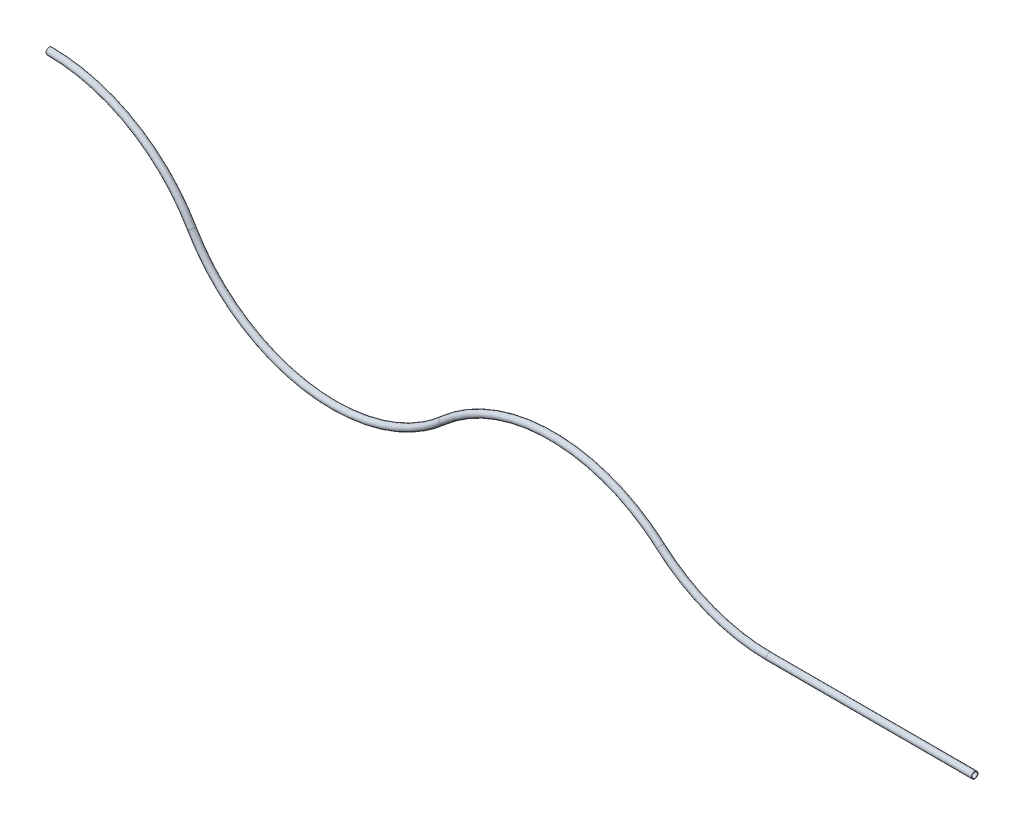
ISO-10303-21;
HEADER;
FILE_DESCRIPTION(('STEP AP214'),'2;1');
FILE_NAME('part.step','',(''),(''),'','','');
FILE_SCHEMA(('AUTOMOTIVE_DESIGN { 1 0 10303 214 1 1 1 1 }'));
ENDSEC;
DATA;
#1=APPLICATION_CONTEXT('core data for automotive mechanical design processes');
#2=APPLICATION_PROTOCOL_DEFINITION('international standard','automotive_design',2000,#1);
#3=PRODUCT_CONTEXT('',#1,'mechanical');
#4=PRODUCT('Part','Part','',(#3));
#5=PRODUCT_RELATED_PRODUCT_CATEGORY('part','',(#4));
#6=PRODUCT_DEFINITION_FORMATION('','',#4);
#7=PRODUCT_DEFINITION_CONTEXT('part definition',#1,'design');
#8=PRODUCT_DEFINITION('design','',#6,#7);
#9=PRODUCT_DEFINITION_SHAPE('','',#8);
#10=(LENGTH_UNIT() NAMED_UNIT(*) SI_UNIT(.MILLI.,.METRE.));
#11=(NAMED_UNIT(*) PLANE_ANGLE_UNIT() SI_UNIT($,.RADIAN.));
#12=(NAMED_UNIT(*) SI_UNIT($,.STERADIAN.) SOLID_ANGLE_UNIT());
#13=UNCERTAINTY_MEASURE_WITH_UNIT(LENGTH_MEASURE(1.E-05),#10,'distance_accuracy_value','');
#14=(GEOMETRIC_REPRESENTATION_CONTEXT(3) GLOBAL_UNCERTAINTY_ASSIGNED_CONTEXT((#13)) GLOBAL_UNIT_ASSIGNED_CONTEXT((#10,
#11,#12)) REPRESENTATION_CONTEXT('',''));
#15=CARTESIAN_POINT('',(0.,0.,0.));
#16=DIRECTION('',(0.,0.,1.));
#17=DIRECTION('',(1.,0.,0.));
#18=AXIS2_PLACEMENT_3D('',#15,#16,#17);
#19=CARTESIAN_POINT('',(5337.41634303793,4.44089209850063E-13,0.));
#20=DIRECTION('',(1.,0.,0.));
#21=DIRECTION('',(0.,0.,-1.));
#22=AXIS2_PLACEMENT_3D('',#19,#20,#21);
#23=CYLINDRICAL_SURFACE('',#22,20.4470000000001);
#24=CARTESIAN_POINT('',(6861.41634303793,4.44089209850063E-13,0.));
#25=DIRECTION('',(-1.,0.,0.));
#26=DIRECTION('',(0.,-1.,0.));
#27=AXIS2_PLACEMENT_3D('',#24,#25,#26);
#28=CIRCLE('',#27,20.4470000000001);
#29=CARTESIAN_POINT('',(6861.41634303793,-20.4469999999997,0.));
#30=VERTEX_POINT('',#29);
#31=EDGE_CURVE('E50',#30,#30,#28,.T.);
#32=ORIENTED_EDGE('',*,*,#31,.F.);
#33=EDGE_LOOP('',(#32));
#34=FACE_BOUND('',#33,.T.);
#35=CARTESIAN_POINT('',(5337.41634303792,2.22044604925031E-13,0.));
#36=DIRECTION('',(1.,0.,0.));
#37=DIRECTION('',(0.,1.,0.));
#38=AXIS2_PLACEMENT_3D('',#35,#36,#37);
#39=CIRCLE('',#38,20.4470000000001);
#40=CARTESIAN_POINT('',(5337.41634303792,-20.4469999999999,0.));
#41=VERTEX_POINT('',#40);
#42=EDGE_CURVE('E110',#41,#41,#39,.T.);
#43=ORIENTED_EDGE('',*,*,#42,.F.);
#44=EDGE_LOOP('',(#43));
#45=FACE_BOUND('',#44,.T.);
#46=ADVANCED_FACE('F42',(#34,#45),#23,.F.);
#47=CARTESIAN_POINT('',(5337.41634303793,4.44089209850063E-13,0.));
#48=DIRECTION('',(1.,0.,0.));
#49=DIRECTION('',(0.,0.,-1.));
#50=AXIS2_PLACEMENT_3D('',#47,#48,#49);
#51=CYLINDRICAL_SURFACE('',#50,24.13);
#52=CARTESIAN_POINT('',(6861.41634303793,4.44089209850063E-13,0.));
#53=DIRECTION('',(-1.,0.,0.));
#54=DIRECTION('',(0.,-1.,0.));
#55=AXIS2_PLACEMENT_3D('',#52,#53,#54);
#56=CIRCLE('',#55,24.13);
#57=CARTESIAN_POINT('',(6861.41634303793,-24.1299999999996,0.));
#58=VERTEX_POINT('',#57);
#59=EDGE_CURVE('E116',#58,#58,#56,.T.);
#60=ORIENTED_EDGE('',*,*,#59,.T.);
#61=EDGE_LOOP('',(#60));
#62=FACE_BOUND('',#61,.T.);
#63=CARTESIAN_POINT('',(5337.41634303792,4.44089209850063E-13,0.));
#64=DIRECTION('',(-1.,0.,0.));
#65=DIRECTION('',(0.,-1.,0.));
#66=AXIS2_PLACEMENT_3D('',#63,#64,#65);
#67=CIRCLE('',#66,24.13);
#68=CARTESIAN_POINT('',(5337.41634303792,-24.1299999999998,0.));
#69=VERTEX_POINT('',#68);
#70=EDGE_CURVE('E12',#69,#69,#67,.T.);
#71=ORIENTED_EDGE('',*,*,#70,.F.);
#72=EDGE_LOOP('',(#71));
#73=FACE_BOUND('',#72,.T.);
#74=ADVANCED_FACE('F44',(#62,#73),#51,.T.);
#75=CARTESIAN_POINT('',(6861.41634303793,4.44089209850063E-13,0.));
#76=DIRECTION('',(-1.,0.,0.));
#77=DIRECTION('',(0.,-1.,0.));
#78=AXIS2_PLACEMENT_3D('',#75,#76,#77);
#79=PLANE('',#78);
#80=ORIENTED_EDGE('',*,*,#31,.T.);
#81=EDGE_LOOP('',(#80));
#82=FACE_BOUND('',#81,.T.);
#83=ORIENTED_EDGE('',*,*,#59,.F.);
#84=EDGE_LOOP('',(#83));
#85=FACE_BOUND('',#84,.T.);
#86=ADVANCED_FACE('F123',(#82,#85),#79,.F.);
#87=CARTESIAN_POINT('',(5337.41634303792,1219.2,0.));
#88=DIRECTION('',(0.,0.,1.));
#89=DIRECTION('',(1.,0.,0.));
#90=AXIS2_PLACEMENT_3D('',#87,#88,#89);
#91=TOROIDAL_SURFACE('',#90,1219.2,20.4470000000001);
#92=CARTESIAN_POINT('',(4530.99134342544,304.800000000001,0.));
#93=DIRECTION('',(0.75,-0.661437827766148,0.));
#94=DIRECTION('',(0.661437827766148,0.75,0.));
#95=AXIS2_PLACEMENT_3D('',#92,#93,#94);
#96=CIRCLE('',#95,20.4470000000001);
#97=CARTESIAN_POINT('',(4517.4669241611,289.46475,0.));
#98=VERTEX_POINT('',#97);
#99=EDGE_CURVE('E108',#98,#98,#96,.T.);
#100=CARTESIAN_POINT('',(5337.41634303792,1219.2,0.));
#101=DIRECTION('',(0.,0.,1.));
#102=DIRECTION('',(1.,0.,0.));
#103=AXIS2_PLACEMENT_3D('',#100,#101,#102);
#104=CIRCLE('',#103,1239.647);
#105=EDGE_CURVE('',#98,#41,#104,.T.);
#106=ORIENTED_EDGE('',*,*,#99,.F.);
#107=ORIENTED_EDGE('',*,*,#42,.T.);
#108=ORIENTED_EDGE('',*,*,#105,.T.);
#109=ORIENTED_EDGE('',*,*,#105,.F.);
#110=EDGE_LOOP('',(#106,#108,#107,#109));
#111=FACE_BOUND('',#110,.T.);
#112=ADVANCED_FACE('F130',(#111),#91,.F.);
#113=CARTESIAN_POINT('',(5337.41634303792,1219.2,0.));
#114=DIRECTION('',(0.,0.,1.));
#115=DIRECTION('',(1.,0.,0.));
#116=AXIS2_PLACEMENT_3D('',#113,#114,#115);
#117=TOROIDAL_SURFACE('',#116,1219.2,24.13);
#118=CARTESIAN_POINT('',(4530.99134342544,304.8,0.));
#119=DIRECTION('',(-0.75,0.661437827766148,0.));
#120=DIRECTION('',(-0.661437827766148,-0.75,0.));
#121=AXIS2_PLACEMENT_3D('',#118,#119,#120);
#122=CIRCLE('',#121,24.13);
#123=CARTESIAN_POINT('',(4515.03084864144,286.7025,0.));
#124=VERTEX_POINT('',#123);
#125=EDGE_CURVE('E113',#124,#124,#122,.T.);
#126=CARTESIAN_POINT('',(5337.41634303792,1219.2,0.));
#127=DIRECTION('',(0.,0.,1.));
#128=DIRECTION('',(1.,0.,0.));
#129=AXIS2_PLACEMENT_3D('',#126,#127,#128);
#130=CIRCLE('',#129,1243.33);
#131=EDGE_CURVE('',#124,#69,#130,.T.);
#132=ORIENTED_EDGE('',*,*,#125,.F.);
#133=ORIENTED_EDGE('',*,*,#70,.T.);
#134=ORIENTED_EDGE('',*,*,#131,.T.);
#135=ORIENTED_EDGE('',*,*,#131,.F.);
#136=EDGE_LOOP('',(#132,#134,#133,#135));
#137=FACE_BOUND('',#136,.T.);
#138=ADVANCED_FACE('F132',(#137),#117,.T.);
#139=CARTESIAN_POINT('',(3724.56634381295,-609.6,0.));
#140=DIRECTION('',(0.,0.,-1.));
#141=DIRECTION('',(-1.,0.,0.));
#142=AXIS2_PLACEMENT_3D('',#139,#140,#141);
#143=TOROIDAL_SURFACE('',#142,1219.2,20.4470000000001);
#144=CARTESIAN_POINT('',(2918.14134420046,304.800000000001,0.));
#145=DIRECTION('',(-0.75,-0.661437827766148,0.));
#146=DIRECTION('',(0.661437827766148,-0.75,0.));
#147=AXIS2_PLACEMENT_3D('',#144,#145,#146);
#148=CIRCLE('',#147,20.4470000000001);
#149=CARTESIAN_POINT('',(2918.14134420046,304.800000000001,20.4470000000001));
#150=VERTEX_POINT('',#149);
#151=CARTESIAN_POINT('',(2918.14134420046,304.800000000001,-20.4470000000001));
#152=VERTEX_POINT('',#151);
#153=EDGE_CURVE('E104',#150,#152,#148,.T.);
#154=ORIENTED_EDGE('',*,*,#153,.T.);
#155=CARTESIAN_POINT('',(2918.14134420046,304.800000000001,0.));
#156=DIRECTION('',(0.75,0.661437827766148,0.));
#157=DIRECTION('',(-0.661437827766148,0.75,0.));
#158=AXIS2_PLACEMENT_3D('',#155,#156,#157);
#159=CIRCLE('',#158,20.4470000000001);
#160=EDGE_CURVE('E63',#150,#152,#159,.T.);
#161=ORIENTED_EDGE('',*,*,#160,.F.);
#162=EDGE_LOOP('',(#154,#161));
#163=FACE_BOUND('',#162,.T.);
#164=ORIENTED_EDGE('',*,*,#99,.T.);
#165=EDGE_LOOP('',(#164));
#166=FACE_BOUND('',#165,.T.);
#167=ADVANCED_FACE('F139',(#163,#166),#143,.F.);
#168=CARTESIAN_POINT('',(3724.56634381295,-609.6,0.));
#169=DIRECTION('',(0.,0.,-1.));
#170=DIRECTION('',(-1.,0.,0.));
#171=AXIS2_PLACEMENT_3D('',#168,#169,#170);
#172=TOROIDAL_SURFACE('',#171,1219.2,24.13);
#173=CARTESIAN_POINT('',(2918.14134420046,304.800000000001,0.));
#174=DIRECTION('',(-0.75,-0.661437827766148,0.));
#175=DIRECTION('',(0.661437827766148,-0.75,0.));
#176=AXIS2_PLACEMENT_3D('',#173,#174,#175);
#177=CIRCLE('',#176,24.13);
#178=CARTESIAN_POINT('',(2918.14134420046,304.800000000001,24.13));
#179=VERTEX_POINT('',#178);
#180=CARTESIAN_POINT('',(2918.14134420046,304.800000000001,-24.13));
#181=VERTEX_POINT('',#180);
#182=EDGE_CURVE('E56',#179,#181,#177,.T.);
#183=ORIENTED_EDGE('',*,*,#182,.F.);
#184=CARTESIAN_POINT('',(2918.14134420046,304.800000000001,0.));
#185=DIRECTION('',(0.75,0.661437827766148,0.));
#186=DIRECTION('',(-0.661437827766148,0.75,0.));
#187=AXIS2_PLACEMENT_3D('',#184,#185,#186);
#188=CIRCLE('',#187,24.13);
#189=EDGE_CURVE('E88',#179,#181,#188,.T.);
#190=ORIENTED_EDGE('',*,*,#189,.T.);
#191=EDGE_LOOP('',(#183,#190));
#192=FACE_BOUND('',#191,.T.);
#193=ORIENTED_EDGE('',*,*,#125,.T.);
#194=EDGE_LOOP('',(#193));
#195=FACE_BOUND('',#194,.T.);
#196=ADVANCED_FACE('F145',(#192,#195),#172,.T.);
#197=CARTESIAN_POINT('',(2111.71634458798,1219.2,0.));
#198=DIRECTION('',(0.,0.,1.));
#199=DIRECTION('',(1.,0.,0.));
#200=AXIS2_PLACEMENT_3D('',#197,#198,#199);
#201=TOROIDAL_SURFACE('',#200,1219.2,20.4470000000001);
#202=CARTESIAN_POINT('',(1055.85817229399,609.600000000001,0.));
#203=DIRECTION('',(-0.5,0.866025403784439,0.));
#204=DIRECTION('',(-0.866025403784439,-0.5,0.));
#205=AXIS2_PLACEMENT_3D('',#202,#203,#204);
#206=CIRCLE('',#205,20.4470000000001);
#207=CARTESIAN_POINT('',(1055.85817229399,609.600000000001,20.4470000000001));
#208=VERTEX_POINT('',#207);
#209=CARTESIAN_POINT('',(1055.85817229399,609.600000000001,-20.4470000000001));
#210=VERTEX_POINT('',#209);
#211=EDGE_CURVE('E91',#208,#210,#206,.T.);
#212=ORIENTED_EDGE('',*,*,#211,.T.);
#213=CARTESIAN_POINT('',(1055.85817229399,609.6,0.));
#214=DIRECTION('',(0.5,-0.866025403784439,0.));
#215=DIRECTION('',(0.866025403784439,0.5,0.));
#216=AXIS2_PLACEMENT_3D('',#213,#214,#215);
#217=CIRCLE('',#216,20.4470000000001);
#218=EDGE_CURVE('E97',#208,#210,#217,.T.);
#219=ORIENTED_EDGE('',*,*,#218,.F.);
#220=EDGE_LOOP('',(#212,#219));
#221=FACE_BOUND('',#220,.T.);
#222=ORIENTED_EDGE('',*,*,#160,.T.);
#223=ORIENTED_EDGE('',*,*,#153,.F.);
#224=EDGE_LOOP('',(#222,#223));
#225=FACE_BOUND('',#224,.T.);
#226=ADVANCED_FACE('F148',(#221,#225),#201,.F.);
#227=CARTESIAN_POINT('',(2111.71634458798,1219.2,0.));
#228=DIRECTION('',(0.,0.,1.));
#229=DIRECTION('',(1.,0.,0.));
#230=AXIS2_PLACEMENT_3D('',#227,#228,#229);
#231=TOROIDAL_SURFACE('',#230,1219.2,24.13);
#232=CARTESIAN_POINT('',(1055.85817229399,609.600000000001,0.));
#233=DIRECTION('',(-0.5,0.866025403784439,0.));
#234=DIRECTION('',(-0.866025403784439,-0.5,0.));
#235=AXIS2_PLACEMENT_3D('',#232,#233,#234);
#236=CIRCLE('',#235,24.13);
#237=CARTESIAN_POINT('',(1055.85817229399,609.600000000001,24.13));
#238=VERTEX_POINT('',#237);
#239=CARTESIAN_POINT('',(1055.85817229399,609.600000000001,-24.13));
#240=VERTEX_POINT('',#239);
#241=EDGE_CURVE('E82',#238,#240,#236,.T.);
#242=ORIENTED_EDGE('',*,*,#241,.F.);
#243=CARTESIAN_POINT('',(1055.85817229399,609.6,0.));
#244=DIRECTION('',(0.5,-0.866025403784439,0.));
#245=DIRECTION('',(0.866025403784439,0.5,0.));
#246=AXIS2_PLACEMENT_3D('',#243,#244,#245);
#247=CIRCLE('',#246,24.13);
#248=EDGE_CURVE('E86',#238,#240,#247,.T.);
#249=ORIENTED_EDGE('',*,*,#248,.T.);
#250=EDGE_LOOP('',(#242,#249));
#251=FACE_BOUND('',#250,.T.);
#252=ORIENTED_EDGE('',*,*,#189,.F.);
#253=ORIENTED_EDGE('',*,*,#182,.T.);
#254=EDGE_LOOP('',(#252,#253));
#255=FACE_BOUND('',#254,.T.);
#256=ADVANCED_FACE('F84',(#251,#255),#231,.T.);
#257=CARTESIAN_POINT('',(0.,0.,0.));
#258=DIRECTION('',(0.,0.,-1.));
#259=DIRECTION('',(-1.,0.,0.));
#260=AXIS2_PLACEMENT_3D('',#257,#258,#259);
#261=TOROIDAL_SURFACE('',#260,1219.2,20.4470000000001);
#262=CARTESIAN_POINT('',(0.,1219.2,0.));
#263=DIRECTION('',(-1.,0.,0.));
#264=DIRECTION('',(0.,-1.,0.));
#265=AXIS2_PLACEMENT_3D('',#262,#263,#264);
#266=CIRCLE('',#265,20.4470000000001);
#267=CARTESIAN_POINT('',(0.,1198.753,0.));
#268=VERTEX_POINT('',#267);
#269=EDGE_CURVE('E100',#268,#268,#266,.T.);
#270=ORIENTED_EDGE('',*,*,#269,.T.);
#271=EDGE_LOOP('',(#270));
#272=FACE_BOUND('',#271,.T.);
#273=ORIENTED_EDGE('',*,*,#218,.T.);
#274=ORIENTED_EDGE('',*,*,#211,.F.);
#275=EDGE_LOOP('',(#273,#274));
#276=FACE_BOUND('',#275,.T.);
#277=ADVANCED_FACE('F154',(#272,#276),#261,.F.);
#278=CARTESIAN_POINT('',(0.,0.,0.));
#279=DIRECTION('',(0.,0.,-1.));
#280=DIRECTION('',(-1.,0.,0.));
#281=AXIS2_PLACEMENT_3D('',#278,#279,#280);
#282=TOROIDAL_SURFACE('',#281,1219.2,24.13);
#283=CARTESIAN_POINT('',(0.,1219.2,0.));
#284=DIRECTION('',(-1.,0.,0.));
#285=DIRECTION('',(0.,-1.,0.));
#286=AXIS2_PLACEMENT_3D('',#283,#284,#285);
#287=CIRCLE('',#286,24.13);
#288=CARTESIAN_POINT('',(0.,1195.07,0.));
#289=VERTEX_POINT('',#288);
#290=EDGE_CURVE('E92',#289,#289,#287,.T.);
#291=ORIENTED_EDGE('',*,*,#290,.F.);
#292=EDGE_LOOP('',(#291));
#293=FACE_BOUND('',#292,.T.);
#294=ORIENTED_EDGE('',*,*,#248,.F.);
#295=ORIENTED_EDGE('',*,*,#241,.T.);
#296=EDGE_LOOP('',(#294,#295));
#297=FACE_BOUND('',#296,.T.);
#298=ADVANCED_FACE('F90',(#293,#297),#282,.T.);
#299=CARTESIAN_POINT('',(0.,1219.2,0.));
#300=DIRECTION('',(-1.,0.,0.));
#301=DIRECTION('',(0.,-1.,0.));
#302=AXIS2_PLACEMENT_3D('',#299,#300,#301);
#303=PLANE('',#302);
#304=ORIENTED_EDGE('',*,*,#269,.F.);
#305=EDGE_LOOP('',(#304));
#306=FACE_BOUND('',#305,.T.);
#307=ORIENTED_EDGE('',*,*,#290,.T.);
#308=EDGE_LOOP('',(#307));
#309=FACE_BOUND('',#308,.T.);
#310=ADVANCED_FACE('F160',(#306,#309),#303,.T.);
#311=CLOSED_SHELL('',(#46,#74,#86,#112,#138,#167,#196,#226,#256,#277,#298,#310));
#312=MANIFOLD_SOLID_BREP('B2',#311);
#313=ADVANCED_BREP_SHAPE_REPRESENTATION('',(#18,#312),#14);
#314=SHAPE_DEFINITION_REPRESENTATION(#9,#313);
ENDSEC;
END-ISO-10303-21;
